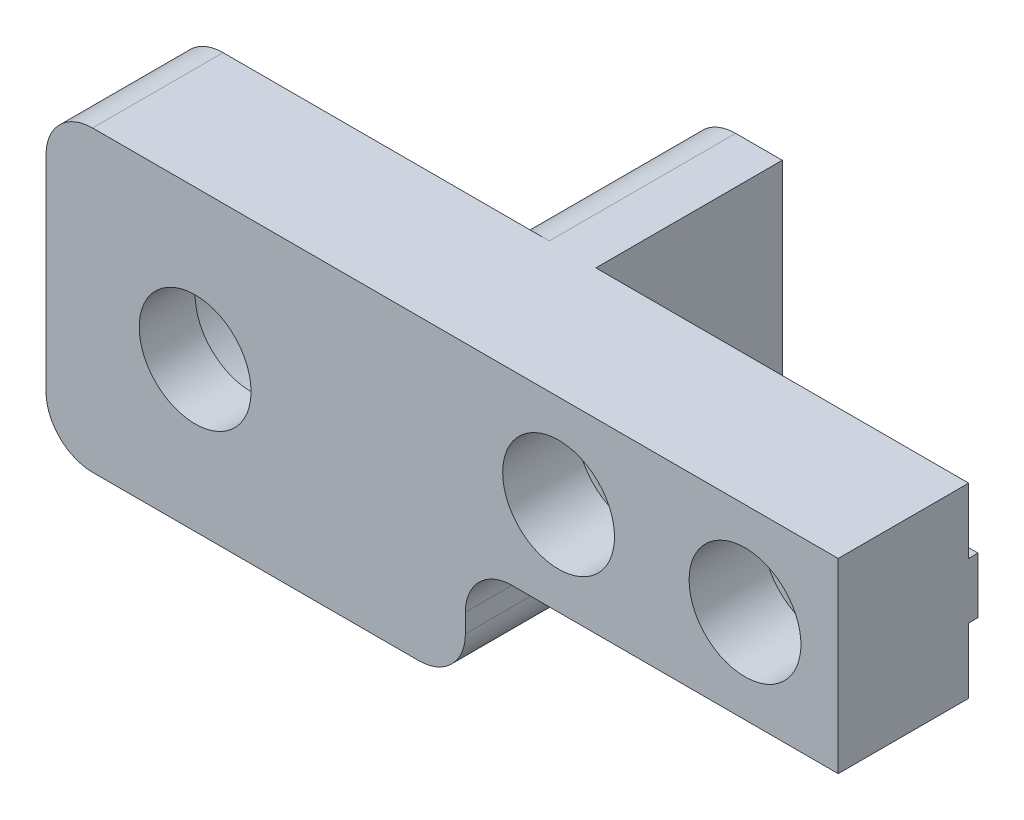
ISO-10303-21;
HEADER;
FILE_DESCRIPTION(('STEP AP214'),'2;1');
FILE_NAME('part.step','',(''),(''),'','','');
FILE_SCHEMA(('AUTOMOTIVE_DESIGN { 1 0 10303 214 1 1 1 1 }'));
ENDSEC;
DATA;
#1=APPLICATION_CONTEXT('core data for automotive mechanical design processes');
#2=APPLICATION_PROTOCOL_DEFINITION('international standard','automotive_design',2000,#1);
#3=PRODUCT_CONTEXT('',#1,'mechanical');
#4=PRODUCT('Part','Part','',(#3));
#5=PRODUCT_RELATED_PRODUCT_CATEGORY('part','',(#4));
#6=PRODUCT_DEFINITION_FORMATION('','',#4);
#7=PRODUCT_DEFINITION_CONTEXT('part definition',#1,'design');
#8=PRODUCT_DEFINITION('design','',#6,#7);
#9=PRODUCT_DEFINITION_SHAPE('','',#8);
#10=(LENGTH_UNIT() NAMED_UNIT(*) SI_UNIT(.MILLI.,.METRE.));
#11=(NAMED_UNIT(*) PLANE_ANGLE_UNIT() SI_UNIT($,.RADIAN.));
#12=(NAMED_UNIT(*) SI_UNIT($,.STERADIAN.) SOLID_ANGLE_UNIT());
#13=UNCERTAINTY_MEASURE_WITH_UNIT(LENGTH_MEASURE(1.E-05),#10,'distance_accuracy_value','');
#14=(GEOMETRIC_REPRESENTATION_CONTEXT(3) GLOBAL_UNCERTAINTY_ASSIGNED_CONTEXT((#13)) GLOBAL_UNIT_ASSIGNED_CONTEXT((#10,
#11,#12)) REPRESENTATION_CONTEXT('',''));
#15=CARTESIAN_POINT('',(0.,0.,0.));
#16=DIRECTION('',(0.,0.,1.));
#17=DIRECTION('',(1.,0.,0.));
#18=AXIS2_PLACEMENT_3D('',#15,#16,#17);
#19=CARTESIAN_POINT('',(-10.,-10.,-40.));
#20=DIRECTION('',(0.,0.,1.));
#21=DIRECTION('',(-1.,0.,0.));
#22=AXIS2_PLACEMENT_3D('',#19,#20,#21);
#23=CYLINDRICAL_SURFACE('',#22,2.75);
#24=CARTESIAN_POINT('',(-10.,-10.,-15.));
#25=DIRECTION('',(0.,0.,-1.));
#26=DIRECTION('',(-1.,0.,0.));
#27=AXIS2_PLACEMENT_3D('',#24,#25,#26);
#28=CIRCLE('',#27,2.75);
#29=CARTESIAN_POINT('',(-12.75,-10.,-15.));
#30=VERTEX_POINT('',#29);
#31=EDGE_CURVE('E327',#30,#30,#28,.T.);
#32=ORIENTED_EDGE('',*,*,#31,.T.);
#33=EDGE_LOOP('',(#32));
#34=FACE_BOUND('',#33,.T.);
#35=CARTESIAN_POINT('',(-10.,-10.,-8.));
#36=DIRECTION('',(0.,0.,-1.));
#37=DIRECTION('',(-1.,0.,0.));
#38=AXIS2_PLACEMENT_3D('',#35,#36,#37);
#39=CIRCLE('',#38,2.75);
#40=CARTESIAN_POINT('',(-12.75,-10.,-8.));
#41=VERTEX_POINT('',#40);
#42=EDGE_CURVE('E45',#41,#41,#39,.F.);
#43=ORIENTED_EDGE('',*,*,#42,.T.);
#44=EDGE_LOOP('',(#43));
#45=FACE_BOUND('',#44,.T.);
#46=ADVANCED_FACE('F41',(#34,#45),#23,.F.);
#47=CARTESIAN_POINT('',(-30.,-10.,-40.));
#48=DIRECTION('',(0.,0.,1.));
#49=DIRECTION('',(-1.,0.,0.));
#50=AXIS2_PLACEMENT_3D('',#47,#48,#49);
#51=CYLINDRICAL_SURFACE('',#50,2.75);
#52=CARTESIAN_POINT('',(-30.,-10.,-15.));
#53=DIRECTION('',(0.,0.,-1.));
#54=DIRECTION('',(-1.,0.,0.));
#55=AXIS2_PLACEMENT_3D('',#52,#53,#54);
#56=CIRCLE('',#55,2.75);
#57=CARTESIAN_POINT('',(-32.75,-10.,-15.));
#58=VERTEX_POINT('',#57);
#59=EDGE_CURVE('E330',#58,#58,#56,.T.);
#60=ORIENTED_EDGE('',*,*,#59,.T.);
#61=EDGE_LOOP('',(#60));
#62=FACE_BOUND('',#61,.T.);
#63=CARTESIAN_POINT('',(-30.,-10.,-8.));
#64=DIRECTION('',(0.,0.,-1.));
#65=DIRECTION('',(-1.,0.,0.));
#66=AXIS2_PLACEMENT_3D('',#63,#64,#65);
#67=CIRCLE('',#66,2.75);
#68=CARTESIAN_POINT('',(-32.75,-10.,-8.));
#69=VERTEX_POINT('',#68);
#70=EDGE_CURVE('E333',#69,#69,#67,.F.);
#71=ORIENTED_EDGE('',*,*,#70,.T.);
#72=EDGE_LOOP('',(#71));
#73=FACE_BOUND('',#72,.T.);
#74=ADVANCED_FACE('F410',(#62,#73),#51,.F.);
#75=CARTESIAN_POINT('',(0.,0.,-14.));
#76=DIRECTION('',(0.,0.,-1.));
#77=DIRECTION('',(1.,0.,0.));
#78=AXIS2_PLACEMENT_3D('',#75,#76,#77);
#79=PLANE('',#78);
#80=DIRECTION('',(1.,0.,0.));
#81=VECTOR('',#80,1.);
#82=CARTESIAN_POINT('',(-40.,-7.,-14.));
#83=LINE('',#82,#81);
#84=CARTESIAN_POINT('',(-40.,-7.,-14.));
#85=VERTEX_POINT('',#84);
#86=CARTESIAN_POINT('',(0.,-7.,-14.));
#87=VERTEX_POINT('',#86);
#88=EDGE_CURVE('E184',#85,#87,#83,.T.);
#89=ORIENTED_EDGE('',*,*,#88,.F.);
#90=DIRECTION('',(0.,1.,0.));
#91=VECTOR('',#90,1.);
#92=CARTESIAN_POINT('',(-40.,-32.,-14.));
#93=LINE('',#92,#91);
#94=CARTESIAN_POINT('',(-40.,0.,-14.));
#95=VERTEX_POINT('',#94);
#96=EDGE_CURVE('E211',#85,#95,#93,.T.);
#97=ORIENTED_EDGE('',*,*,#96,.T.);
#98=DIRECTION('',(-1.,0.,0.));
#99=VECTOR('',#98,1.);
#100=CARTESIAN_POINT('',(0.,0.,-14.));
#101=LINE('',#100,#99);
#102=CARTESIAN_POINT('',(0.,0.,-14.));
#103=VERTEX_POINT('',#102);
#104=EDGE_CURVE('E238',#103,#95,#101,.T.);
#105=ORIENTED_EDGE('',*,*,#104,.F.);
#106=DIRECTION('',(0.,1.,0.));
#107=VECTOR('',#106,1.);
#108=CARTESIAN_POINT('',(0.,-20.,-14.));
#109=LINE('',#108,#107);
#110=EDGE_CURVE('E237',#87,#103,#109,.T.);
#111=ORIENTED_EDGE('',*,*,#110,.F.);
#112=EDGE_LOOP('',(#89,#97,#105,#111));
#113=FACE_BOUND('',#112,.T.);
#114=ADVANCED_FACE('F367',(#113),#79,.T.);
#115=DIRECTION('',(0.,-1.,0.));
#116=VECTOR('',#115,1.);
#117=CARTESIAN_POINT('',(-85.,0.,-14.));
#118=LINE('',#117,#116);
#119=CARTESIAN_POINT('',(-85.,-5.00000000000001,-14.));
#120=VERTEX_POINT('',#119);
#121=CARTESIAN_POINT('',(-85.,-27.,-14.));
#122=VERTEX_POINT('',#121);
#123=EDGE_CURVE('E241',#120,#122,#118,.T.);
#124=ORIENTED_EDGE('',*,*,#123,.F.);
#125=CARTESIAN_POINT('',(-80.,-5.00000000000001,-14.));
#126=DIRECTION('',(0.,0.,1.));
#127=DIRECTION('',(1.,0.,0.));
#128=AXIS2_PLACEMENT_3D('',#125,#126,#127);
#129=CIRCLE('',#128,5.);
#130=CARTESIAN_POINT('',(-80.,0.,-14.));
#131=VERTEX_POINT('',#130);
#132=EDGE_CURVE('E303',#131,#120,#129,.T.);
#133=ORIENTED_EDGE('',*,*,#132,.F.);
#134=CARTESIAN_POINT('',(-45.,0.,-14.));
#135=VERTEX_POINT('',#134);
#136=EDGE_CURVE('E236',#135,#131,#101,.T.);
#137=ORIENTED_EDGE('',*,*,#136,.F.);
#138=CARTESIAN_POINT('',(-45.,-5.,-14.));
#139=DIRECTION('',(0.,0.,1.));
#140=DIRECTION('',(1.,0.,0.));
#141=AXIS2_PLACEMENT_3D('',#138,#139,#140);
#142=CIRCLE('',#141,5.);
#143=CARTESIAN_POINT('',(-50.,-5.,-14.));
#144=VERTEX_POINT('',#143);
#145=EDGE_CURVE('E11',#144,#135,#142,.F.);
#146=ORIENTED_EDGE('',*,*,#145,.F.);
#147=DIRECTION('',(0.,-1.,0.));
#148=VECTOR('',#147,1.);
#149=CARTESIAN_POINT('',(-50.,0.,-14.));
#150=LINE('',#149,#148);
#151=CARTESIAN_POINT('',(-50.,-27.,-14.));
#152=VERTEX_POINT('',#151);
#153=EDGE_CURVE('E200',#144,#152,#150,.T.);
#154=ORIENTED_EDGE('',*,*,#153,.T.);
#155=CARTESIAN_POINT('',(-45.,-27.,-14.));
#156=DIRECTION('',(0.,0.,1.));
#157=DIRECTION('',(1.,0.,0.));
#158=AXIS2_PLACEMENT_3D('',#155,#156,#157);
#159=CIRCLE('',#158,5.);
#160=CARTESIAN_POINT('',(-45.,-32.,-14.));
#161=VERTEX_POINT('',#160);
#162=EDGE_CURVE('E50',#161,#152,#159,.F.);
#163=ORIENTED_EDGE('',*,*,#162,.F.);
#164=DIRECTION('',(1.,0.,0.));
#165=VECTOR('',#164,1.);
#166=CARTESIAN_POINT('',(-85.,-32.,-14.));
#167=LINE('',#166,#165);
#168=CARTESIAN_POINT('',(-80.,-32.,-14.));
#169=VERTEX_POINT('',#168);
#170=EDGE_CURVE('E244',#169,#161,#167,.T.);
#171=ORIENTED_EDGE('',*,*,#170,.F.);
#172=CARTESIAN_POINT('',(-80.,-27.,-14.));
#173=DIRECTION('',(0.,0.,1.));
#174=DIRECTION('',(1.,0.,0.));
#175=AXIS2_PLACEMENT_3D('',#172,#173,#174);
#176=CIRCLE('',#175,5.);
#177=EDGE_CURVE('E306',#122,#169,#176,.T.);
#178=ORIENTED_EDGE('',*,*,#177,.F.);
#179=EDGE_LOOP('',(#124,#133,#137,#146,#154,#163,#171,#178));
#180=FACE_BOUND('',#179,.T.);
#181=CARTESIAN_POINT('',(-69.,-16.,-14.));
#182=DIRECTION('',(0.,0.,1.));
#183=DIRECTION('',(1.,0.,0.));
#184=AXIS2_PLACEMENT_3D('',#181,#182,#183);
#185=CIRCLE('',#184,11.25);
#186=CARTESIAN_POINT('',(-57.75,-16.,-14.));
#187=VERTEX_POINT('',#186);
#188=EDGE_CURVE('E226',#187,#187,#185,.T.);
#189=ORIENTED_EDGE('',*,*,#188,.T.);
#190=EDGE_LOOP('',(#189));
#191=FACE_BOUND('',#190,.T.);
#192=ADVANCED_FACE('F407',(#180,#191),#79,.T.);
#193=CARTESIAN_POINT('',(0.,-20.,-14.));
#194=DIRECTION('',(-1.,0.,0.));
#195=DIRECTION('',(0.,0.,-1.));
#196=AXIS2_PLACEMENT_3D('',#193,#194,#195);
#197=PLANE('',#196);
#198=DIRECTION('',(0.,1.,0.));
#199=VECTOR('',#198,1.);
#200=CARTESIAN_POINT('',(0.,-20.,0.));
#201=LINE('',#200,#199);
#202=CARTESIAN_POINT('',(0.,-20.,0.));
#203=VERTEX_POINT('',#202);
#204=CARTESIAN_POINT('',(0.,0.,0.));
#205=VERTEX_POINT('',#204);
#206=EDGE_CURVE('E232',#203,#205,#201,.T.);
#207=ORIENTED_EDGE('',*,*,#206,.F.);
#208=DIRECTION('',(0.,0.,1.));
#209=VECTOR('',#208,1.);
#210=CARTESIAN_POINT('',(0.,-20.,-14.));
#211=LINE('',#210,#209);
#212=CARTESIAN_POINT('',(0.,-20.,-14.));
#213=VERTEX_POINT('',#212);
#214=EDGE_CURVE('E249',#213,#203,#211,.T.);
#215=ORIENTED_EDGE('',*,*,#214,.F.);
#216=CARTESIAN_POINT('',(0.,-13.,-14.));
#217=VERTEX_POINT('',#216);
#218=EDGE_CURVE('E190',#213,#217,#109,.T.);
#219=ORIENTED_EDGE('',*,*,#218,.T.);
#220=DIRECTION('',(0.,0.,1.));
#221=VECTOR('',#220,1.);
#222=CARTESIAN_POINT('',(0.,-13.,-15.));
#223=LINE('',#222,#221);
#224=CARTESIAN_POINT('',(0.,-13.,-15.));
#225=VERTEX_POINT('',#224);
#226=EDGE_CURVE('E173',#225,#217,#223,.T.);
#227=ORIENTED_EDGE('',*,*,#226,.F.);
#228=DIRECTION('',(0.,-1.,0.));
#229=VECTOR('',#228,1.);
#230=CARTESIAN_POINT('',(0.,-7.,-15.));
#231=LINE('',#230,#229);
#232=CARTESIAN_POINT('',(0.,-7.,-15.));
#233=VERTEX_POINT('',#232);
#234=EDGE_CURVE('E179',#233,#225,#231,.T.);
#235=ORIENTED_EDGE('',*,*,#234,.F.);
#236=DIRECTION('',(0.,0.,1.));
#237=VECTOR('',#236,1.);
#238=CARTESIAN_POINT('',(0.,-7.,-15.));
#239=LINE('',#238,#237);
#240=EDGE_CURVE('E326',#233,#87,#239,.T.);
#241=ORIENTED_EDGE('',*,*,#240,.T.);
#242=ORIENTED_EDGE('',*,*,#110,.T.);
#243=DIRECTION('',(0.,0.,1.));
#244=VECTOR('',#243,1.);
#245=CARTESIAN_POINT('',(0.,0.,-14.));
#246=LINE('',#245,#244);
#247=EDGE_CURVE('E268',#103,#205,#246,.T.);
#248=ORIENTED_EDGE('',*,*,#247,.T.);
#249=EDGE_LOOP('',(#207,#215,#219,#227,#235,#241,#242,#248));
#250=FACE_BOUND('',#249,.T.);
#251=ADVANCED_FACE('F187',(#250),#197,.F.);
#252=CARTESIAN_POINT('',(0.,0.,-14.));
#253=DIRECTION('',(0.,-1.,0.));
#254=DIRECTION('',(1.,0.,0.));
#255=AXIS2_PLACEMENT_3D('',#252,#253,#254);
#256=PLANE('',#255);
#257=DIRECTION('',(-1.,0.,0.));
#258=VECTOR('',#257,1.);
#259=CARTESIAN_POINT('',(0.,0.,0.));
#260=LINE('',#259,#258);
#261=CARTESIAN_POINT('',(-80.,0.,0.));
#262=VERTEX_POINT('',#261);
#263=EDGE_CURVE('E252',#205,#262,#260,.T.);
#264=ORIENTED_EDGE('',*,*,#263,.F.);
#265=ORIENTED_EDGE('',*,*,#247,.F.);
#266=ORIENTED_EDGE('',*,*,#104,.T.);
#267=DIRECTION('',(0.,0.,1.));
#268=VECTOR('',#267,1.);
#269=CARTESIAN_POINT('',(-40.,0.,-34.));
#270=LINE('',#269,#268);
#271=CARTESIAN_POINT('',(-40.,0.,-34.));
#272=VERTEX_POINT('',#271);
#273=EDGE_CURVE('E206',#272,#95,#270,.T.);
#274=ORIENTED_EDGE('',*,*,#273,.F.);
#275=DIRECTION('',(-1.,0.,0.));
#276=VECTOR('',#275,1.);
#277=CARTESIAN_POINT('',(-40.,0.,-34.));
#278=LINE('',#277,#276);
#279=CARTESIAN_POINT('',(-45.,0.,-34.));
#280=VERTEX_POINT('',#279);
#281=EDGE_CURVE('E199',#272,#280,#278,.T.);
#282=ORIENTED_EDGE('',*,*,#281,.T.);
#283=DIRECTION('',(0.,0.,1.));
#284=VECTOR('',#283,1.);
#285=CARTESIAN_POINT('',(-45.,0.,-14.));
#286=LINE('',#285,#284);
#287=EDGE_CURVE('E309',#135,#280,#286,.F.);
#288=ORIENTED_EDGE('',*,*,#287,.F.);
#289=ORIENTED_EDGE('',*,*,#136,.T.);
#290=DIRECTION('',(0.,0.,1.));
#291=VECTOR('',#290,1.);
#292=CARTESIAN_POINT('',(-80.,0.,-14.));
#293=LINE('',#292,#291);
#294=EDGE_CURVE('E312',#262,#131,#293,.F.);
#295=ORIENTED_EDGE('',*,*,#294,.F.);
#296=EDGE_LOOP('',(#264,#265,#266,#274,#282,#288,#289,#295));
#297=FACE_BOUND('',#296,.T.);
#298=ADVANCED_FACE('F395',(#297),#256,.F.);
#299=CARTESIAN_POINT('',(-85.,0.,-14.));
#300=DIRECTION('',(1.,0.,0.));
#301=DIRECTION('',(0.,0.,1.));
#302=AXIS2_PLACEMENT_3D('',#299,#300,#301);
#303=PLANE('',#302);
#304=DIRECTION('',(0.,-1.,0.));
#305=VECTOR('',#304,1.);
#306=CARTESIAN_POINT('',(-85.,0.,0.));
#307=LINE('',#306,#305);
#308=CARTESIAN_POINT('',(-85.,-5.00000000000001,0.));
#309=VERTEX_POINT('',#308);
#310=CARTESIAN_POINT('',(-85.,-27.,0.));
#311=VERTEX_POINT('',#310);
#312=EDGE_CURVE('E255',#309,#311,#307,.T.);
#313=ORIENTED_EDGE('',*,*,#312,.F.);
#314=DIRECTION('',(0.,0.,1.));
#315=VECTOR('',#314,1.);
#316=CARTESIAN_POINT('',(-85.,-5.00000000000001,-14.));
#317=LINE('',#316,#315);
#318=EDGE_CURVE('E298',#120,#309,#317,.T.);
#319=ORIENTED_EDGE('',*,*,#318,.F.);
#320=ORIENTED_EDGE('',*,*,#123,.T.);
#321=DIRECTION('',(0.,0.,1.));
#322=VECTOR('',#321,1.);
#323=CARTESIAN_POINT('',(-85.,-27.,-14.));
#324=LINE('',#323,#322);
#325=EDGE_CURVE('E301',#311,#122,#324,.F.);
#326=ORIENTED_EDGE('',*,*,#325,.F.);
#327=EDGE_LOOP('',(#313,#319,#320,#326));
#328=FACE_BOUND('',#327,.T.);
#329=ADVANCED_FACE('F398',(#328),#303,.F.);
#330=CARTESIAN_POINT('',(-85.,-32.,-14.));
#331=DIRECTION('',(0.,1.,0.));
#332=DIRECTION('',(-1.,0.,0.));
#333=AXIS2_PLACEMENT_3D('',#330,#331,#332);
#334=PLANE('',#333);
#335=ORIENTED_EDGE('',*,*,#170,.T.);
#336=DIRECTION('',(0.,0.,1.));
#337=VECTOR('',#336,1.);
#338=CARTESIAN_POINT('',(-45.,-32.,-14.));
#339=LINE('',#338,#337);
#340=CARTESIAN_POINT('',(-45.,-32.,0.));
#341=VERTEX_POINT('',#340);
#342=EDGE_CURVE('E282',#341,#161,#339,.F.);
#343=ORIENTED_EDGE('',*,*,#342,.F.);
#344=DIRECTION('',(1.,0.,0.));
#345=VECTOR('',#344,1.);
#346=CARTESIAN_POINT('',(-85.,-32.,0.));
#347=LINE('',#346,#345);
#348=CARTESIAN_POINT('',(-80.,-32.,0.));
#349=VERTEX_POINT('',#348);
#350=EDGE_CURVE('E258',#349,#341,#347,.T.);
#351=ORIENTED_EDGE('',*,*,#350,.F.);
#352=DIRECTION('',(0.,0.,1.));
#353=VECTOR('',#352,1.);
#354=CARTESIAN_POINT('',(-80.,-32.,-14.));
#355=LINE('',#354,#353);
#356=EDGE_CURVE('E285',#169,#349,#355,.T.);
#357=ORIENTED_EDGE('',*,*,#356,.F.);
#358=EDGE_LOOP('',(#335,#343,#351,#357));
#359=FACE_BOUND('',#358,.T.);
#360=ADVANCED_FACE('F404',(#359),#334,.F.);
#361=CARTESIAN_POINT('',(-40.,-32.,-14.));
#362=DIRECTION('',(-1.,0.,0.));
#363=DIRECTION('',(0.,0.,-1.));
#364=AXIS2_PLACEMENT_3D('',#361,#362,#363);
#365=PLANE('',#364);
#366=DIRECTION('',(0.,1.,0.));
#367=VECTOR('',#366,1.);
#368=CARTESIAN_POINT('',(-40.,-13.,-15.));
#369=LINE('',#368,#367);
#370=CARTESIAN_POINT('',(-40.,-13.,-15.));
#371=VERTEX_POINT('',#370);
#372=CARTESIAN_POINT('',(-40.,-7.,-15.));
#373=VERTEX_POINT('',#372);
#374=EDGE_CURVE('E178',#371,#373,#369,.T.);
#375=ORIENTED_EDGE('',*,*,#374,.F.);
#376=DIRECTION('',(0.,0.,1.));
#377=VECTOR('',#376,1.);
#378=CARTESIAN_POINT('',(-40.,-13.,-15.));
#379=LINE('',#378,#377);
#380=CARTESIAN_POINT('',(-40.,-13.,-14.));
#381=VERTEX_POINT('',#380);
#382=EDGE_CURVE('E176',#371,#381,#379,.T.);
#383=ORIENTED_EDGE('',*,*,#382,.T.);
#384=CARTESIAN_POINT('',(-40.,-25.,-14.));
#385=VERTEX_POINT('',#384);
#386=EDGE_CURVE('E207',#385,#381,#93,.T.);
#387=ORIENTED_EDGE('',*,*,#386,.F.);
#388=DIRECTION('',(0.,0.,1.));
#389=VECTOR('',#388,1.);
#390=CARTESIAN_POINT('',(-40.,-25.,-14.));
#391=LINE('',#390,#389);
#392=CARTESIAN_POINT('',(-40.,-25.,0.));
#393=VERTEX_POINT('',#392);
#394=EDGE_CURVE('E210',#393,#385,#391,.F.);
#395=ORIENTED_EDGE('',*,*,#394,.F.);
#396=DIRECTION('',(0.,1.,0.));
#397=VECTOR('',#396,1.);
#398=CARTESIAN_POINT('',(-40.,-32.,0.));
#399=LINE('',#398,#397);
#400=CARTESIAN_POINT('',(-40.,-27.,0.));
#401=VERTEX_POINT('',#400);
#402=EDGE_CURVE('E261',#401,#393,#399,.T.);
#403=ORIENTED_EDGE('',*,*,#402,.F.);
#404=DIRECTION('',(0.,0.,1.));
#405=VECTOR('',#404,1.);
#406=CARTESIAN_POINT('',(-40.,-27.,-14.));
#407=LINE('',#406,#405);
#408=CARTESIAN_POINT('',(-40.,-27.,-34.));
#409=VERTEX_POINT('',#408);
#410=EDGE_CURVE('E273',#409,#401,#407,.T.);
#411=ORIENTED_EDGE('',*,*,#410,.F.);
#412=DIRECTION('',(0.,1.,0.));
#413=VECTOR('',#412,1.);
#414=CARTESIAN_POINT('',(-40.,-32.,-34.));
#415=LINE('',#414,#413);
#416=EDGE_CURVE('E197',#409,#272,#415,.T.);
#417=ORIENTED_EDGE('',*,*,#416,.T.);
#418=ORIENTED_EDGE('',*,*,#273,.T.);
#419=ORIENTED_EDGE('',*,*,#96,.F.);
#420=DIRECTION('',(0.,0.,1.));
#421=VECTOR('',#420,1.);
#422=CARTESIAN_POINT('',(-40.,-7.,-15.));
#423=LINE('',#422,#421);
#424=EDGE_CURVE('E192',#373,#85,#423,.T.);
#425=ORIENTED_EDGE('',*,*,#424,.F.);
#426=EDGE_LOOP('',(#375,#383,#387,#395,#403,#411,#417,#418,#419,#425));
#427=FACE_BOUND('',#426,.T.);
#428=ADVANCED_FACE('F362',(#427),#365,.F.);
#429=CARTESIAN_POINT('',(-40.,-20.,-14.));
#430=DIRECTION('',(0.,1.,0.));
#431=DIRECTION('',(0.,0.,-1.));
#432=AXIS2_PLACEMENT_3D('',#429,#430,#431);
#433=PLANE('',#432);
#434=DIRECTION('',(1.,0.,0.));
#435=VECTOR('',#434,1.);
#436=CARTESIAN_POINT('',(-40.,-20.,-14.));
#437=LINE('',#436,#435);
#438=CARTESIAN_POINT('',(-35.,-20.,-14.));
#439=VERTEX_POINT('',#438);
#440=EDGE_CURVE('E247',#439,#213,#437,.T.);
#441=ORIENTED_EDGE('',*,*,#440,.T.);
#442=ORIENTED_EDGE('',*,*,#214,.T.);
#443=DIRECTION('',(1.,0.,0.));
#444=VECTOR('',#443,1.);
#445=CARTESIAN_POINT('',(-40.,-20.,0.));
#446=LINE('',#445,#444);
#447=CARTESIAN_POINT('',(-35.,-20.,0.));
#448=VERTEX_POINT('',#447);
#449=EDGE_CURVE('E264',#448,#203,#446,.T.);
#450=ORIENTED_EDGE('',*,*,#449,.F.);
#451=DIRECTION('',(0.,0.,1.));
#452=VECTOR('',#451,1.);
#453=CARTESIAN_POINT('',(-35.,-20.,0.));
#454=LINE('',#453,#452);
#455=EDGE_CURVE('E295',#439,#448,#454,.T.);
#456=ORIENTED_EDGE('',*,*,#455,.F.);
#457=EDGE_LOOP('',(#441,#442,#450,#456));
#458=FACE_BOUND('',#457,.T.);
#459=ADVANCED_FACE('F375',(#458),#433,.F.);
#460=DIRECTION('',(-1.,0.,0.));
#461=VECTOR('',#460,1.);
#462=CARTESIAN_POINT('',(0.,-13.,-14.));
#463=LINE('',#462,#461);
#464=EDGE_CURVE('E332',#217,#381,#463,.T.);
#465=ORIENTED_EDGE('',*,*,#464,.F.);
#466=ORIENTED_EDGE('',*,*,#218,.F.);
#467=ORIENTED_EDGE('',*,*,#440,.F.);
#468=CARTESIAN_POINT('',(-35.,-25.,-14.));
#469=DIRECTION('',(0.,0.,1.));
#470=DIRECTION('',(1.,0.,0.));
#471=AXIS2_PLACEMENT_3D('',#468,#469,#470);
#472=CIRCLE('',#471,5.);
#473=EDGE_CURVE('E321',#385,#439,#472,.F.);
#474=ORIENTED_EDGE('',*,*,#473,.F.);
#475=ORIENTED_EDGE('',*,*,#386,.T.);
#476=EDGE_LOOP('',(#465,#466,#467,#474,#475));
#477=FACE_BOUND('',#476,.T.);
#478=ADVANCED_FACE('F378',(#477),#79,.T.);
#479=CARTESIAN_POINT('',(0.,0.,0.));
#480=DIRECTION('',(0.,0.,-1.));
#481=DIRECTION('',(1.,0.,0.));
#482=AXIS2_PLACEMENT_3D('',#479,#480,#481);
#483=PLANE('',#482);
#484=CARTESIAN_POINT('',(-10.,-10.,0.));
#485=DIRECTION('',(0.,0.,-1.));
#486=DIRECTION('',(-1.,0.,0.));
#487=AXIS2_PLACEMENT_3D('',#484,#485,#486);
#488=CIRCLE('',#487,6.);
#489=CARTESIAN_POINT('',(-16.,-10.,0.));
#490=VERTEX_POINT('',#489);
#491=EDGE_CURVE('E340',#490,#490,#488,.T.);
#492=ORIENTED_EDGE('',*,*,#491,.T.);
#493=EDGE_LOOP('',(#492));
#494=FACE_BOUND('',#493,.T.);
#495=CARTESIAN_POINT('',(-30.,-10.,0.));
#496=DIRECTION('',(0.,0.,-1.));
#497=DIRECTION('',(-1.,0.,0.));
#498=AXIS2_PLACEMENT_3D('',#495,#496,#497);
#499=CIRCLE('',#498,6.);
#500=CARTESIAN_POINT('',(-36.,-10.,0.));
#501=VERTEX_POINT('',#500);
#502=EDGE_CURVE('E345',#501,#501,#499,.T.);
#503=ORIENTED_EDGE('',*,*,#502,.T.);
#504=EDGE_LOOP('',(#503));
#505=FACE_BOUND('',#504,.T.);
#506=CARTESIAN_POINT('',(-69.,-16.,0.));
#507=DIRECTION('',(0.,0.,1.));
#508=DIRECTION('',(1.,0.,0.));
#509=AXIS2_PLACEMENT_3D('',#506,#507,#508);
#510=CIRCLE('',#509,6.);
#511=CARTESIAN_POINT('',(-63.,-16.,0.));
#512=VERTEX_POINT('',#511);
#513=EDGE_CURVE('E219',#512,#512,#510,.F.);
#514=ORIENTED_EDGE('',*,*,#513,.T.);
#515=EDGE_LOOP('',(#514));
#516=FACE_BOUND('',#515,.T.);
#517=ORIENTED_EDGE('',*,*,#402,.T.);
#518=CARTESIAN_POINT('',(-35.,-25.,0.));
#519=DIRECTION('',(0.,0.,1.));
#520=DIRECTION('',(1.,0.,0.));
#521=AXIS2_PLACEMENT_3D('',#518,#519,#520);
#522=CIRCLE('',#521,5.);
#523=EDGE_CURVE('E319',#448,#393,#522,.T.);
#524=ORIENTED_EDGE('',*,*,#523,.F.);
#525=ORIENTED_EDGE('',*,*,#449,.T.);
#526=ORIENTED_EDGE('',*,*,#206,.T.);
#527=ORIENTED_EDGE('',*,*,#263,.T.);
#528=CARTESIAN_POINT('',(-80.,-5.00000000000001,0.));
#529=DIRECTION('',(0.,0.,1.));
#530=DIRECTION('',(1.,0.,0.));
#531=AXIS2_PLACEMENT_3D('',#528,#529,#530);
#532=CIRCLE('',#531,5.);
#533=EDGE_CURVE('E276',#309,#262,#532,.F.);
#534=ORIENTED_EDGE('',*,*,#533,.F.);
#535=ORIENTED_EDGE('',*,*,#312,.T.);
#536=CARTESIAN_POINT('',(-80.,-27.,0.));
#537=DIRECTION('',(0.,0.,1.));
#538=DIRECTION('',(1.,0.,0.));
#539=AXIS2_PLACEMENT_3D('',#536,#537,#538);
#540=CIRCLE('',#539,5.);
#541=EDGE_CURVE('E278',#349,#311,#540,.F.);
#542=ORIENTED_EDGE('',*,*,#541,.F.);
#543=ORIENTED_EDGE('',*,*,#350,.T.);
#544=CARTESIAN_POINT('',(-45.,-27.,0.));
#545=DIRECTION('',(0.,0.,1.));
#546=DIRECTION('',(1.,0.,0.));
#547=AXIS2_PLACEMENT_3D('',#544,#545,#546);
#548=CIRCLE('',#547,5.);
#549=EDGE_CURVE('E280',#401,#341,#548,.F.);
#550=ORIENTED_EDGE('',*,*,#549,.F.);
#551=EDGE_LOOP('',(#517,#524,#525,#526,#527,#534,#535,#542,#543,#550));
#552=FACE_BOUND('',#551,.T.);
#553=ADVANCED_FACE('F371',(#494,#505,#516,#552),#483,.F.);
#554=CARTESIAN_POINT('',(-69.,-16.,-7.));
#555=DIRECTION('',(0.,0.,-1.));
#556=DIRECTION('',(1.,0.,0.));
#557=AXIS2_PLACEMENT_3D('',#554,#555,#556);
#558=CYLINDRICAL_SURFACE('',#557,11.25);
#559=CARTESIAN_POINT('',(-69.,-16.,-7.));
#560=DIRECTION('',(0.,0.,1.));
#561=DIRECTION('',(1.,0.,0.));
#562=AXIS2_PLACEMENT_3D('',#559,#560,#561);
#563=CIRCLE('',#562,11.25);
#564=CARTESIAN_POINT('',(-57.75,-16.,-7.));
#565=VERTEX_POINT('',#564);
#566=EDGE_CURVE('E229',#565,#565,#563,.T.);
#567=ORIENTED_EDGE('',*,*,#566,.T.);
#568=EDGE_LOOP('',(#567));
#569=FACE_BOUND('',#568,.T.);
#570=ORIENTED_EDGE('',*,*,#188,.F.);
#571=EDGE_LOOP('',(#570));
#572=FACE_BOUND('',#571,.T.);
#573=ADVANCED_FACE('F451',(#569,#572),#558,.F.);
#574=CARTESIAN_POINT('',(-69.,-16.,-7.));
#575=DIRECTION('',(0.,0.,-1.));
#576=DIRECTION('',(1.,0.,0.));
#577=AXIS2_PLACEMENT_3D('',#574,#575,#576);
#578=PLANE('',#577);
#579=CARTESIAN_POINT('',(-69.,-16.,-7.));
#580=DIRECTION('',(0.,0.,1.));
#581=DIRECTION('',(1.,0.,0.));
#582=AXIS2_PLACEMENT_3D('',#579,#580,#581);
#583=CIRCLE('',#582,9.);
#584=CARTESIAN_POINT('',(-60.,-16.,-7.));
#585=VERTEX_POINT('',#584);
#586=EDGE_CURVE('E222',#585,#585,#583,.T.);
#587=ORIENTED_EDGE('',*,*,#586,.T.);
#588=EDGE_LOOP('',(#587));
#589=FACE_BOUND('',#588,.T.);
#590=ORIENTED_EDGE('',*,*,#566,.F.);
#591=EDGE_LOOP('',(#590));
#592=FACE_BOUND('',#591,.T.);
#593=ADVANCED_FACE('F447',(#589,#592),#578,.T.);
#594=CARTESIAN_POINT('',(-69.,-16.,-6.));
#595=DIRECTION('',(0.,0.,-1.));
#596=DIRECTION('',(1.,0.,0.));
#597=AXIS2_PLACEMENT_3D('',#594,#595,#596);
#598=CYLINDRICAL_SURFACE('',#597,9.);
#599=CARTESIAN_POINT('',(-69.,-16.,-6.));
#600=DIRECTION('',(0.,0.,1.));
#601=DIRECTION('',(1.,0.,0.));
#602=AXIS2_PLACEMENT_3D('',#599,#600,#601);
#603=CIRCLE('',#602,9.);
#604=CARTESIAN_POINT('',(-60.,-16.,-6.));
#605=VERTEX_POINT('',#604);
#606=EDGE_CURVE('E223',#605,#605,#603,.T.);
#607=ORIENTED_EDGE('',*,*,#606,.T.);
#608=EDGE_LOOP('',(#607));
#609=FACE_BOUND('',#608,.T.);
#610=ORIENTED_EDGE('',*,*,#586,.F.);
#611=EDGE_LOOP('',(#610));
#612=FACE_BOUND('',#611,.T.);
#613=ADVANCED_FACE('F443',(#609,#612),#598,.F.);
#614=CARTESIAN_POINT('',(-69.,-16.,-6.));
#615=DIRECTION('',(0.,0.,-1.));
#616=DIRECTION('',(1.,0.,0.));
#617=AXIS2_PLACEMENT_3D('',#614,#615,#616);
#618=PLANE('',#617);
#619=CARTESIAN_POINT('',(-69.,-16.,-6.));
#620=DIRECTION('',(0.,0.,1.));
#621=DIRECTION('',(1.,0.,0.));
#622=AXIS2_PLACEMENT_3D('',#619,#620,#621);
#623=CIRCLE('',#622,6.);
#624=CARTESIAN_POINT('',(-63.,-16.,-6.));
#625=VERTEX_POINT('',#624);
#626=EDGE_CURVE('E216',#625,#625,#623,.T.);
#627=ORIENTED_EDGE('',*,*,#626,.T.);
#628=EDGE_LOOP('',(#627));
#629=FACE_BOUND('',#628,.T.);
#630=ORIENTED_EDGE('',*,*,#606,.F.);
#631=EDGE_LOOP('',(#630));
#632=FACE_BOUND('',#631,.T.);
#633=ADVANCED_FACE('F439',(#629,#632),#618,.T.);
#634=CARTESIAN_POINT('',(-69.,-16.,0.00100000000000013));
#635=DIRECTION('',(0.,0.,-1.));
#636=DIRECTION('',(1.,0.,0.));
#637=AXIS2_PLACEMENT_3D('',#634,#635,#636);
#638=CYLINDRICAL_SURFACE('',#637,6.);
#639=CARTESIAN_POINT('',(-63.,-16.,-6.));
#640=CARTESIAN_POINT('',(-63.,-16.,-5.9375));
#641=CARTESIAN_POINT('',(-63.,-16.,-5.875));
#642=CARTESIAN_POINT('',(-63.,-16.,-5.75));
#643=CARTESIAN_POINT('',(-63.,-16.,-5.6875));
#644=CARTESIAN_POINT('',(-63.,-16.,-5.5625));
#645=CARTESIAN_POINT('',(-63.,-16.,-5.5));
#646=CARTESIAN_POINT('',(-63.,-16.,-5.375));
#647=CARTESIAN_POINT('',(-63.,-16.,-5.3125));
#648=CARTESIAN_POINT('',(-63.,-16.,-5.1875));
#649=CARTESIAN_POINT('',(-63.,-16.,-5.125));
#650=CARTESIAN_POINT('',(-63.,-16.,-5.));
#651=CARTESIAN_POINT('',(-63.,-16.,-4.9375));
#652=CARTESIAN_POINT('',(-63.,-16.,-4.8125));
#653=CARTESIAN_POINT('',(-63.,-16.,-4.75));
#654=CARTESIAN_POINT('',(-63.,-16.,-4.625));
#655=CARTESIAN_POINT('',(-63.,-16.,-4.5625));
#656=CARTESIAN_POINT('',(-63.,-16.,-4.4375));
#657=CARTESIAN_POINT('',(-63.,-16.,-4.375));
#658=CARTESIAN_POINT('',(-63.,-16.,-4.25));
#659=CARTESIAN_POINT('',(-63.,-16.,-4.1875));
#660=CARTESIAN_POINT('',(-63.,-16.,-4.0625));
#661=CARTESIAN_POINT('',(-63.,-16.,-4.));
#662=CARTESIAN_POINT('',(-63.,-16.,-3.875));
#663=CARTESIAN_POINT('',(-63.,-16.,-3.8125));
#664=CARTESIAN_POINT('',(-63.,-16.,-3.6875));
#665=CARTESIAN_POINT('',(-63.,-16.,-3.625));
#666=CARTESIAN_POINT('',(-63.,-16.,-3.5));
#667=CARTESIAN_POINT('',(-63.,-16.,-3.4375));
#668=CARTESIAN_POINT('',(-63.,-16.,-3.3125));
#669=CARTESIAN_POINT('',(-63.,-16.,-3.25));
#670=CARTESIAN_POINT('',(-63.,-16.,-3.125));
#671=CARTESIAN_POINT('',(-63.,-16.,-3.0625));
#672=CARTESIAN_POINT('',(-63.,-16.,-2.9375));
#673=CARTESIAN_POINT('',(-63.,-16.,-2.875));
#674=CARTESIAN_POINT('',(-63.,-16.,-2.75));
#675=CARTESIAN_POINT('',(-63.,-16.,-2.6875));
#676=CARTESIAN_POINT('',(-63.,-16.,-2.5625));
#677=CARTESIAN_POINT('',(-63.,-16.,-2.5));
#678=CARTESIAN_POINT('',(-63.,-16.,-2.375));
#679=CARTESIAN_POINT('',(-63.,-16.,-2.3125));
#680=CARTESIAN_POINT('',(-63.,-16.,-2.1875));
#681=CARTESIAN_POINT('',(-63.,-16.,-2.125));
#682=CARTESIAN_POINT('',(-63.,-16.,-2.));
#683=CARTESIAN_POINT('',(-63.,-16.,-1.9375));
#684=CARTESIAN_POINT('',(-63.,-16.,-1.8125));
#685=CARTESIAN_POINT('',(-63.,-16.,-1.75));
#686=CARTESIAN_POINT('',(-63.,-16.,-1.625));
#687=CARTESIAN_POINT('',(-63.,-16.,-1.5625));
#688=CARTESIAN_POINT('',(-63.,-16.,-1.4375));
#689=CARTESIAN_POINT('',(-63.,-16.,-1.375));
#690=CARTESIAN_POINT('',(-63.,-16.,-1.25));
#691=CARTESIAN_POINT('',(-63.,-16.,-1.1875));
#692=CARTESIAN_POINT('',(-63.,-16.,-1.0625));
#693=CARTESIAN_POINT('',(-63.,-16.,-1.));
#694=CARTESIAN_POINT('',(-63.,-16.,-0.875));
#695=CARTESIAN_POINT('',(-63.,-16.,-0.8125));
#696=CARTESIAN_POINT('',(-63.,-16.,-0.6875));
#697=CARTESIAN_POINT('',(-63.,-16.,-0.625));
#698=CARTESIAN_POINT('',(-63.,-16.,-0.5));
#699=CARTESIAN_POINT('',(-63.,-16.,-0.4375));
#700=CARTESIAN_POINT('',(-63.,-16.,-0.3125));
#701=CARTESIAN_POINT('',(-63.,-16.,-0.25));
#702=CARTESIAN_POINT('',(-63.,-16.,-0.125));
#703=CARTESIAN_POINT('',(-63.,-16.,-0.0625000000000001));
#704=CARTESIAN_POINT('',(-63.,-16.,0.));
#705=B_SPLINE_CURVE_WITH_KNOTS('',3,(#639,#640,#641,#642,#643,#644,#645,#646,#647,#648,#649,
#650,#651,#652,#653,#654,#655,#656,#657,#658,#659,#660,#661,#662,#663,#664,#665,#666,#667,#668,
#669,#670,#671,#672,#673,#674,#675,#676,#677,#678,#679,#680,#681,#682,#683,#684,#685,#686,#687,
#688,#689,#690,#691,#692,#693,#694,#695,#696,#697,#698,#699,#700,#701,#702,#703,#704),
.UNSPECIFIED.,.F.,.F.,(4,2,2,2,2,2,2,2,2,2,2,2,2,2,2,2,2,2,2,2,2,2,2,2,2,2,2,2,2,2,2,2,4),(0.,
0.1875,0.375,0.5625,0.75,0.9375,1.125,1.3125,1.5,1.6875,1.875,2.0625,2.25,2.4375,2.625,2.8125,
3.,3.1875,3.375,3.5625,3.75,3.9375,4.125,4.3125,4.5,4.6875,4.875,5.0625,5.25,5.4375,5.625,
5.8125,6.),.UNSPECIFIED.);
#706=EDGE_CURVE('BSEAM435',#625,#512,#705,.T.);
#707=ORIENTED_EDGE('',*,*,#626,.F.);
#708=ORIENTED_EDGE('',*,*,#513,.F.);
#709=ORIENTED_EDGE('',*,*,#706,.T.);
#710=ORIENTED_EDGE('',*,*,#706,.F.);
#711=EDGE_LOOP('',(#707,#709,#708,#710));
#712=FACE_BOUND('',#711,.T.);
#713=ADVANCED_FACE('F435',(#712),#638,.F.);
#714=CARTESIAN_POINT('',(-50.,0.,-34.));
#715=DIRECTION('',(1.,0.,0.));
#716=DIRECTION('',(0.,1.,0.));
#717=AXIS2_PLACEMENT_3D('',#714,#715,#716);
#718=PLANE('',#717);
#719=ORIENTED_EDGE('',*,*,#153,.F.);
#720=DIRECTION('',(0.,0.,1.));
#721=VECTOR('',#720,1.);
#722=CARTESIAN_POINT('',(-50.,-5.,-34.));
#723=LINE('',#722,#721);
#724=CARTESIAN_POINT('',(-50.,-5.,-34.));
#725=VERTEX_POINT('',#724);
#726=EDGE_CURVE('E314',#725,#144,#723,.T.);
#727=ORIENTED_EDGE('',*,*,#726,.F.);
#728=DIRECTION('',(0.,-1.,0.));
#729=VECTOR('',#728,1.);
#730=CARTESIAN_POINT('',(-50.,0.,-34.));
#731=LINE('',#730,#729);
#732=CARTESIAN_POINT('',(-50.,-27.,-34.));
#733=VERTEX_POINT('',#732);
#734=EDGE_CURVE('E203',#725,#733,#731,.T.);
#735=ORIENTED_EDGE('',*,*,#734,.T.);
#736=DIRECTION('',(0.,0.,1.));
#737=VECTOR('',#736,1.);
#738=CARTESIAN_POINT('',(-50.,-27.,-34.));
#739=LINE('',#738,#737);
#740=EDGE_CURVE('E316',#152,#733,#739,.F.);
#741=ORIENTED_EDGE('',*,*,#740,.F.);
#742=EDGE_LOOP('',(#719,#727,#735,#741));
#743=FACE_BOUND('',#742,.T.);
#744=ADVANCED_FACE('F432',(#743),#718,.F.);
#745=CARTESIAN_POINT('',(0.,0.,-34.));
#746=DIRECTION('',(0.,0.,-1.));
#747=DIRECTION('',(1.,0.,0.));
#748=AXIS2_PLACEMENT_3D('',#745,#746,#747);
#749=PLANE('',#748);
#750=CARTESIAN_POINT('',(-45.,-27.,-34.));
#751=DIRECTION('',(0.,0.,1.));
#752=DIRECTION('',(1.,0.,0.));
#753=AXIS2_PLACEMENT_3D('',#750,#751,#752);
#754=CIRCLE('',#753,5.);
#755=CARTESIAN_POINT('',(-45.,-32.,-34.));
#756=VERTEX_POINT('',#755);
#757=EDGE_CURVE('E290',#733,#756,#754,.T.);
#758=ORIENTED_EDGE('',*,*,#757,.F.);
#759=ORIENTED_EDGE('',*,*,#734,.F.);
#760=CARTESIAN_POINT('',(-45.,-5.,-34.));
#761=DIRECTION('',(0.,0.,1.));
#762=DIRECTION('',(1.,0.,0.));
#763=AXIS2_PLACEMENT_3D('',#760,#761,#762);
#764=CIRCLE('',#763,5.);
#765=EDGE_CURVE('E288',#280,#725,#764,.T.);
#766=ORIENTED_EDGE('',*,*,#765,.F.);
#767=ORIENTED_EDGE('',*,*,#281,.F.);
#768=ORIENTED_EDGE('',*,*,#416,.F.);
#769=CARTESIAN_POINT('',(-45.,-27.,-34.));
#770=DIRECTION('',(0.,0.,1.));
#771=DIRECTION('',(1.,0.,0.));
#772=AXIS2_PLACEMENT_3D('',#769,#770,#771);
#773=CIRCLE('',#772,5.);
#774=EDGE_CURVE('E293',#756,#409,#773,.T.);
#775=ORIENTED_EDGE('',*,*,#774,.F.);
#776=EDGE_LOOP('',(#758,#759,#766,#767,#768,#775));
#777=FACE_BOUND('',#776,.T.);
#778=ADVANCED_FACE('F393',(#777),#749,.T.);
#779=CARTESIAN_POINT('',(-45.,-27.,-14.));
#780=DIRECTION('',(0.,0.,1.));
#781=DIRECTION('',(-1.,0.,0.));
#782=AXIS2_PLACEMENT_3D('',#779,#780,#781);
#783=CYLINDRICAL_SURFACE('',#782,5.);
#784=ORIENTED_EDGE('',*,*,#740,.T.);
#785=ORIENTED_EDGE('',*,*,#757,.T.);
#786=DIRECTION('',(0.,0.,1.));
#787=VECTOR('',#786,1.);
#788=CARTESIAN_POINT('',(-45.,-32.,-14.));
#789=LINE('',#788,#787);
#790=EDGE_CURVE('E214',#756,#161,#789,.T.);
#791=ORIENTED_EDGE('',*,*,#790,.T.);
#792=ORIENTED_EDGE('',*,*,#162,.T.);
#793=EDGE_LOOP('',(#784,#785,#791,#792));
#794=FACE_BOUND('',#793,.T.);
#795=ADVANCED_FACE('F431',(#794),#783,.T.);
#796=CARTESIAN_POINT('',(-45.,-27.,-14.));
#797=DIRECTION('',(0.,0.,1.));
#798=DIRECTION('',(-1.,0.,0.));
#799=AXIS2_PLACEMENT_3D('',#796,#797,#798);
#800=CYLINDRICAL_SURFACE('',#799,5.);
#801=ORIENTED_EDGE('',*,*,#790,.F.);
#802=ORIENTED_EDGE('',*,*,#774,.T.);
#803=ORIENTED_EDGE('',*,*,#410,.T.);
#804=ORIENTED_EDGE('',*,*,#549,.T.);
#805=ORIENTED_EDGE('',*,*,#342,.T.);
#806=EDGE_LOOP('',(#801,#802,#803,#804,#805));
#807=FACE_BOUND('',#806,.T.);
#808=ADVANCED_FACE('F388',(#807),#800,.T.);
#809=CARTESIAN_POINT('',(-35.,-25.,-14.));
#810=DIRECTION('',(0.,0.,-1.));
#811=DIRECTION('',(1.,0.,0.));
#812=AXIS2_PLACEMENT_3D('',#809,#810,#811);
#813=CYLINDRICAL_SURFACE('',#812,5.);
#814=ORIENTED_EDGE('',*,*,#473,.T.);
#815=ORIENTED_EDGE('',*,*,#455,.T.);
#816=ORIENTED_EDGE('',*,*,#523,.T.);
#817=ORIENTED_EDGE('',*,*,#394,.T.);
#818=EDGE_LOOP('',(#814,#815,#816,#817));
#819=FACE_BOUND('',#818,.T.);
#820=ADVANCED_FACE('F384',(#819),#813,.F.);
#821=CARTESIAN_POINT('',(-80.,-27.,-14.));
#822=DIRECTION('',(0.,0.,1.));
#823=DIRECTION('',(-1.,0.,0.));
#824=AXIS2_PLACEMENT_3D('',#821,#822,#823);
#825=CYLINDRICAL_SURFACE('',#824,5.);
#826=ORIENTED_EDGE('',*,*,#177,.T.);
#827=ORIENTED_EDGE('',*,*,#356,.T.);
#828=ORIENTED_EDGE('',*,*,#541,.T.);
#829=ORIENTED_EDGE('',*,*,#325,.T.);
#830=EDGE_LOOP('',(#826,#827,#828,#829));
#831=FACE_BOUND('',#830,.T.);
#832=ADVANCED_FACE('F488',(#831),#825,.T.);
#833=CARTESIAN_POINT('',(-80.,-5.00000000000001,-14.));
#834=DIRECTION('',(0.,0.,1.));
#835=DIRECTION('',(-1.,0.,0.));
#836=AXIS2_PLACEMENT_3D('',#833,#834,#835);
#837=CYLINDRICAL_SURFACE('',#836,5.);
#838=ORIENTED_EDGE('',*,*,#132,.T.);
#839=ORIENTED_EDGE('',*,*,#318,.T.);
#840=ORIENTED_EDGE('',*,*,#533,.T.);
#841=ORIENTED_EDGE('',*,*,#294,.T.);
#842=EDGE_LOOP('',(#838,#839,#840,#841));
#843=FACE_BOUND('',#842,.T.);
#844=ADVANCED_FACE('F484',(#843),#837,.T.);
#845=CARTESIAN_POINT('',(-45.,-5.,-34.));
#846=DIRECTION('',(0.,0.,1.));
#847=DIRECTION('',(-1.,0.,0.));
#848=AXIS2_PLACEMENT_3D('',#845,#846,#847);
#849=CYLINDRICAL_SURFACE('',#848,5.);
#850=ORIENTED_EDGE('',*,*,#765,.T.);
#851=ORIENTED_EDGE('',*,*,#726,.T.);
#852=ORIENTED_EDGE('',*,*,#145,.T.);
#853=ORIENTED_EDGE('',*,*,#287,.T.);
#854=EDGE_LOOP('',(#850,#851,#852,#853));
#855=FACE_BOUND('',#854,.T.);
#856=ADVANCED_FACE('F43',(#855),#849,.T.);
#857=CARTESIAN_POINT('',(-40.,-7.,-15.));
#858=DIRECTION('',(0.,1.,0.));
#859=DIRECTION('',(0.,0.,-1.));
#860=AXIS2_PLACEMENT_3D('',#857,#858,#859);
#861=PLANE('',#860);
#862=ORIENTED_EDGE('',*,*,#88,.T.);
#863=ORIENTED_EDGE('',*,*,#240,.F.);
#864=DIRECTION('',(1.,0.,0.));
#865=VECTOR('',#864,1.);
#866=CARTESIAN_POINT('',(-40.,-7.,-15.));
#867=LINE('',#866,#865);
#868=EDGE_CURVE('E66',#373,#233,#867,.T.);
#869=ORIENTED_EDGE('',*,*,#868,.F.);
#870=ORIENTED_EDGE('',*,*,#424,.T.);
#871=EDGE_LOOP('',(#862,#863,#869,#870));
#872=FACE_BOUND('',#871,.T.);
#873=ADVANCED_FACE('F358',(#872),#861,.T.);
#874=CARTESIAN_POINT('',(0.,-13.,-15.));
#875=DIRECTION('',(0.,-1.,0.));
#876=DIRECTION('',(1.,0.,0.));
#877=AXIS2_PLACEMENT_3D('',#874,#875,#876);
#878=PLANE('',#877);
#879=ORIENTED_EDGE('',*,*,#464,.T.);
#880=ORIENTED_EDGE('',*,*,#382,.F.);
#881=DIRECTION('',(-1.,0.,0.));
#882=VECTOR('',#881,1.);
#883=CARTESIAN_POINT('',(0.,-13.,-15.));
#884=LINE('',#883,#882);
#885=EDGE_CURVE('E58',#225,#371,#884,.T.);
#886=ORIENTED_EDGE('',*,*,#885,.F.);
#887=ORIENTED_EDGE('',*,*,#226,.T.);
#888=EDGE_LOOP('',(#879,#880,#886,#887));
#889=FACE_BOUND('',#888,.T.);
#890=ADVANCED_FACE('F171',(#889),#878,.T.);
#891=CARTESIAN_POINT('',(0.,0.,-15.));
#892=DIRECTION('',(0.,0.,1.));
#893=DIRECTION('',(-1.,0.,0.));
#894=AXIS2_PLACEMENT_3D('',#891,#892,#893);
#895=PLANE('',#894);
#896=ORIENTED_EDGE('',*,*,#59,.F.);
#897=EDGE_LOOP('',(#896));
#898=FACE_BOUND('',#897,.T.);
#899=ORIENTED_EDGE('',*,*,#31,.F.);
#900=EDGE_LOOP('',(#899));
#901=FACE_BOUND('',#900,.T.);
#902=ORIENTED_EDGE('',*,*,#234,.T.);
#903=ORIENTED_EDGE('',*,*,#885,.T.);
#904=ORIENTED_EDGE('',*,*,#374,.T.);
#905=ORIENTED_EDGE('',*,*,#868,.T.);
#906=EDGE_LOOP('',(#902,#903,#904,#905));
#907=FACE_BOUND('',#906,.T.);
#908=ADVANCED_FACE('F182',(#898,#901,#907),#895,.F.);
#909=CARTESIAN_POINT('',(-30.,-10.,-8.));
#910=DIRECTION('',(0.,0.,1.));
#911=DIRECTION('',(-1.,0.,0.));
#912=AXIS2_PLACEMENT_3D('',#909,#910,#911);
#913=PLANE('',#912);
#914=CARTESIAN_POINT('',(-30.,-10.,-8.));
#915=DIRECTION('',(0.,0.,-1.));
#916=DIRECTION('',(-1.,0.,0.));
#917=AXIS2_PLACEMENT_3D('',#914,#915,#916);
#918=CIRCLE('',#917,6.);
#919=CARTESIAN_POINT('',(-36.,-10.,-8.));
#920=VERTEX_POINT('',#919);
#921=EDGE_CURVE('E350',#920,#920,#918,.T.);
#922=ORIENTED_EDGE('',*,*,#921,.F.);
#923=EDGE_LOOP('',(#922));
#924=FACE_BOUND('',#923,.T.);
#925=ORIENTED_EDGE('',*,*,#70,.F.);
#926=EDGE_LOOP('',(#925));
#927=FACE_BOUND('',#926,.T.);
#928=ADVANCED_FACE('F423',(#924,#927),#913,.T.);
#929=CARTESIAN_POINT('',(-30.,-10.,-8.));
#930=DIRECTION('',(0.,0.,1.));
#931=DIRECTION('',(-1.,0.,0.));
#932=AXIS2_PLACEMENT_3D('',#929,#930,#931);
#933=CYLINDRICAL_SURFACE('',#932,6.);
#934=ORIENTED_EDGE('',*,*,#921,.T.);
#935=EDGE_LOOP('',(#934));
#936=FACE_BOUND('',#935,.T.);
#937=ORIENTED_EDGE('',*,*,#502,.F.);
#938=EDGE_LOOP('',(#937));
#939=FACE_BOUND('',#938,.T.);
#940=ADVANCED_FACE('F558',(#936,#939),#933,.F.);
#941=CARTESIAN_POINT('',(-10.,-10.,-8.));
#942=DIRECTION('',(0.,0.,1.));
#943=DIRECTION('',(-1.,0.,0.));
#944=AXIS2_PLACEMENT_3D('',#941,#942,#943);
#945=PLANE('',#944);
#946=CARTESIAN_POINT('',(-10.,-10.,-8.));
#947=DIRECTION('',(0.,0.,-1.));
#948=DIRECTION('',(-1.,0.,0.));
#949=AXIS2_PLACEMENT_3D('',#946,#947,#948);
#950=CIRCLE('',#949,6.);
#951=CARTESIAN_POINT('',(-16.,-10.,-8.));
#952=VERTEX_POINT('',#951);
#953=EDGE_CURVE('E335',#952,#952,#950,.T.);
#954=ORIENTED_EDGE('',*,*,#953,.F.);
#955=EDGE_LOOP('',(#954));
#956=FACE_BOUND('',#955,.T.);
#957=ORIENTED_EDGE('',*,*,#42,.F.);
#958=EDGE_LOOP('',(#957));
#959=FACE_BOUND('',#958,.T.);
#960=ADVANCED_FACE('F569',(#956,#959),#945,.T.);
#961=CARTESIAN_POINT('',(-10.,-10.,-8.));
#962=DIRECTION('',(0.,0.,1.));
#963=DIRECTION('',(-1.,0.,0.));
#964=AXIS2_PLACEMENT_3D('',#961,#962,#963);
#965=CYLINDRICAL_SURFACE('',#964,6.);
#966=ORIENTED_EDGE('',*,*,#953,.T.);
#967=EDGE_LOOP('',(#966));
#968=FACE_BOUND('',#967,.T.);
#969=ORIENTED_EDGE('',*,*,#491,.F.);
#970=EDGE_LOOP('',(#969));
#971=FACE_BOUND('',#970,.T.);
#972=ADVANCED_FACE('F578',(#968,#971),#965,.F.);
#973=CLOSED_SHELL('',(#46,#74,#114,#192,#251,#298,#329,#360,#428,#459,#478,#553,#573,#593,#613,
#633,#713,#744,#778,#795,#808,#820,#832,#844,#856,#873,#890,#908,#928,#940,#960,#972));
#974=MANIFOLD_SOLID_BREP('B2',#973);
#975=ADVANCED_BREP_SHAPE_REPRESENTATION('',(#18,#974),#14);
#976=SHAPE_DEFINITION_REPRESENTATION(#9,#975);
ENDSEC;
END-ISO-10303-21;
